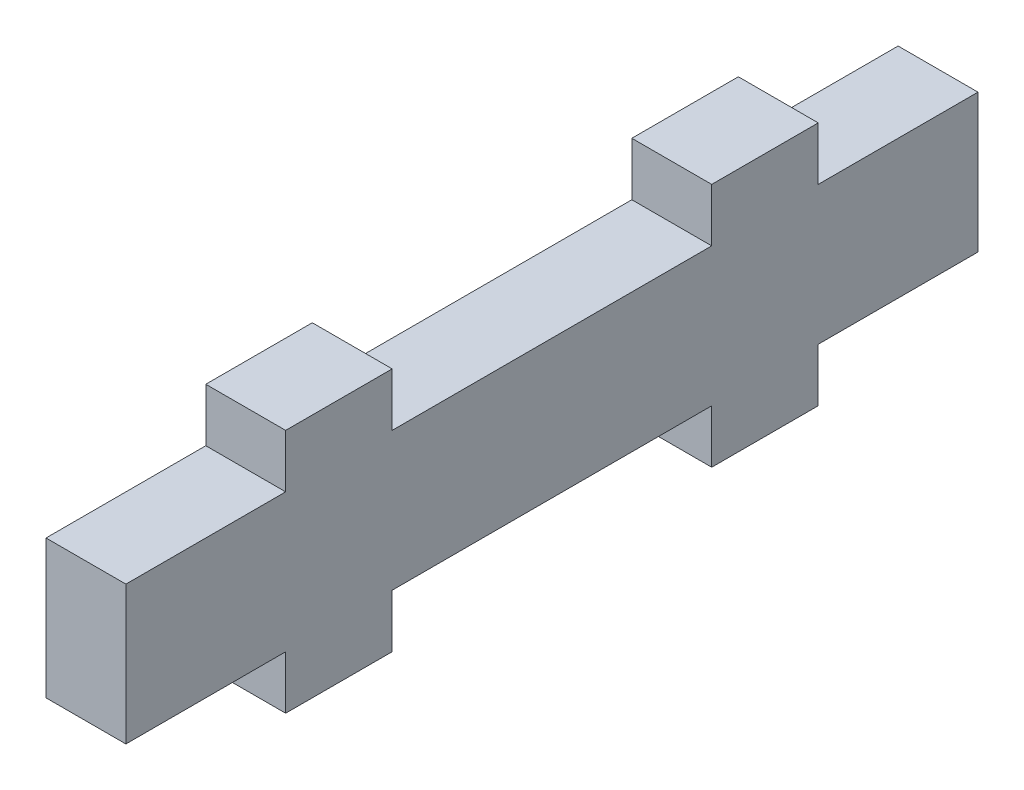
ISO-10303-21;
HEADER;
FILE_DESCRIPTION(('STEP AP214'),'2;1');
FILE_NAME('part.step','',(''),(''),'','','');
FILE_SCHEMA(('AUTOMOTIVE_DESIGN { 1 0 10303 214 1 1 1 1 }'));
ENDSEC;
DATA;
#1=APPLICATION_CONTEXT('core data for automotive mechanical design processes');
#2=APPLICATION_PROTOCOL_DEFINITION('international standard','automotive_design',2000,#1);
#3=PRODUCT_CONTEXT('',#1,'mechanical');
#4=PRODUCT('Part','Part','',(#3));
#5=PRODUCT_RELATED_PRODUCT_CATEGORY('part','',(#4));
#6=PRODUCT_DEFINITION_FORMATION('','',#4);
#7=PRODUCT_DEFINITION_CONTEXT('part definition',#1,'design');
#8=PRODUCT_DEFINITION('design','',#6,#7);
#9=PRODUCT_DEFINITION_SHAPE('','',#8);
#10=(LENGTH_UNIT() NAMED_UNIT(*) SI_UNIT(.MILLI.,.METRE.));
#11=(NAMED_UNIT(*) PLANE_ANGLE_UNIT() SI_UNIT($,.RADIAN.));
#12=(NAMED_UNIT(*) SI_UNIT($,.STERADIAN.) SOLID_ANGLE_UNIT());
#13=UNCERTAINTY_MEASURE_WITH_UNIT(LENGTH_MEASURE(1.E-05),#10,'distance_accuracy_value','');
#14=(GEOMETRIC_REPRESENTATION_CONTEXT(3) GLOBAL_UNCERTAINTY_ASSIGNED_CONTEXT((#13)) GLOBAL_UNIT_ASSIGNED_CONTEXT((#10,
#11,#12)) REPRESENTATION_CONTEXT('',''));
#15=CARTESIAN_POINT('',(0.,0.,0.));
#16=DIRECTION('',(0.,0.,1.));
#17=DIRECTION('',(1.,0.,0.));
#18=AXIS2_PLACEMENT_3D('',#15,#16,#17);
#19=CARTESIAN_POINT('',(45.,-12.9999999999998,0.));
#20=DIRECTION('',(0.,-1.,0.));
#21=DIRECTION('',(0.,0.,-1.));
#22=AXIS2_PLACEMENT_3D('',#19,#20,#21);
#23=PLANE('',#22);
#24=DIRECTION('',(0.,0.,-1.));
#25=VECTOR('',#24,1.);
#26=CARTESIAN_POINT('',(60.,-12.9999999999998,0.));
#27=LINE('',#26,#25);
#28=CARTESIAN_POINT('',(60.,-12.9999999999998,80.0000000000001));
#29=VERTEX_POINT('',#28);
#30=CARTESIAN_POINT('',(60.,-12.9999999999998,50.));
#31=VERTEX_POINT('',#30);
#32=EDGE_CURVE('E208',#29,#31,#27,.T.);
#33=ORIENTED_EDGE('',*,*,#32,.F.);
#34=DIRECTION('',(1.,0.,0.));
#35=VECTOR('',#34,1.);
#36=CARTESIAN_POINT('',(45.,-12.9999999999998,80.0000000000001));
#37=LINE('',#36,#35);
#38=CARTESIAN_POINT('',(45.,-12.9999999999998,80.0000000000001));
#39=VERTEX_POINT('',#38);
#40=EDGE_CURVE('E11',#39,#29,#37,.T.);
#41=ORIENTED_EDGE('',*,*,#40,.F.);
#42=DIRECTION('',(0.,0.,-1.));
#43=VECTOR('',#42,1.);
#44=CARTESIAN_POINT('',(45.,-12.9999999999998,0.));
#45=LINE('',#44,#43);
#46=CARTESIAN_POINT('',(45.,-12.9999999999998,50.));
#47=VERTEX_POINT('',#46);
#48=EDGE_CURVE('E254',#39,#47,#45,.T.);
#49=ORIENTED_EDGE('',*,*,#48,.T.);
#50=DIRECTION('',(1.,0.,0.));
#51=VECTOR('',#50,1.);
#52=CARTESIAN_POINT('',(45.,-12.9999999999998,50.));
#53=LINE('',#52,#51);
#54=EDGE_CURVE('E39',#47,#31,#53,.T.);
#55=ORIENTED_EDGE('',*,*,#54,.T.);
#56=EDGE_LOOP('',(#33,#41,#49,#55));
#57=FACE_BOUND('',#56,.T.);
#58=ADVANCED_FACE('F35',(#57),#23,.T.);
#59=CARTESIAN_POINT('',(45.,0.,80.0000000000001));
#60=DIRECTION('',(0.,0.,-1.));
#61=DIRECTION('',(-1.,0.,0.));
#62=AXIS2_PLACEMENT_3D('',#59,#60,#61);
#63=PLANE('',#62);
#64=DIRECTION('',(0.,1.,0.));
#65=VECTOR('',#64,1.);
#66=CARTESIAN_POINT('',(60.,0.,80.0000000000001));
#67=LINE('',#66,#65);
#68=CARTESIAN_POINT('',(60.,12.9999999999998,80.0000000000001));
#69=VERTEX_POINT('',#68);
#70=EDGE_CURVE('E117',#29,#69,#67,.T.);
#71=ORIENTED_EDGE('',*,*,#70,.T.);
#72=DIRECTION('',(1.,0.,0.));
#73=VECTOR('',#72,1.);
#74=CARTESIAN_POINT('',(45.,12.9999999999998,80.0000000000001));
#75=LINE('',#74,#73);
#76=CARTESIAN_POINT('',(45.,12.9999999999998,80.0000000000001));
#77=VERTEX_POINT('',#76);
#78=EDGE_CURVE('E45',#77,#69,#75,.T.);
#79=ORIENTED_EDGE('',*,*,#78,.F.);
#80=DIRECTION('',(0.,1.,0.));
#81=VECTOR('',#80,1.);
#82=CARTESIAN_POINT('',(45.,0.,80.0000000000001));
#83=LINE('',#82,#81);
#84=EDGE_CURVE('E184',#39,#77,#83,.T.);
#85=ORIENTED_EDGE('',*,*,#84,.F.);
#86=ORIENTED_EDGE('',*,*,#40,.T.);
#87=EDGE_LOOP('',(#71,#79,#85,#86));
#88=FACE_BOUND('',#87,.T.);
#89=ADVANCED_FACE('F386',(#88),#63,.F.);
#90=CARTESIAN_POINT('',(45.,12.9999999999998,0.));
#91=DIRECTION('',(0.,-1.,0.));
#92=DIRECTION('',(0.,0.,-1.));
#93=AXIS2_PLACEMENT_3D('',#90,#91,#92);
#94=PLANE('',#93);
#95=DIRECTION('',(0.,0.,-1.));
#96=VECTOR('',#95,1.);
#97=CARTESIAN_POINT('',(60.,12.9999999999998,0.));
#98=LINE('',#97,#96);
#99=CARTESIAN_POINT('',(60.,12.9999999999998,50.));
#100=VERTEX_POINT('',#99);
#101=EDGE_CURVE('E193',#69,#100,#98,.T.);
#102=ORIENTED_EDGE('',*,*,#101,.T.);
#103=DIRECTION('',(1.,0.,0.));
#104=VECTOR('',#103,1.);
#105=CARTESIAN_POINT('',(45.,12.9999999999998,50.));
#106=LINE('',#105,#104);
#107=CARTESIAN_POINT('',(45.,12.9999999999998,50.));
#108=VERTEX_POINT('',#107);
#109=EDGE_CURVE('E190',#108,#100,#106,.T.);
#110=ORIENTED_EDGE('',*,*,#109,.F.);
#111=DIRECTION('',(0.,0.,-1.));
#112=VECTOR('',#111,1.);
#113=CARTESIAN_POINT('',(45.,12.9999999999998,0.));
#114=LINE('',#113,#112);
#115=EDGE_CURVE('E177',#77,#108,#114,.T.);
#116=ORIENTED_EDGE('',*,*,#115,.F.);
#117=ORIENTED_EDGE('',*,*,#78,.T.);
#118=EDGE_LOOP('',(#102,#110,#116,#117));
#119=FACE_BOUND('',#118,.T.);
#120=ADVANCED_FACE('F191',(#119),#94,.F.);
#121=CARTESIAN_POINT('',(45.,0.,50.));
#122=DIRECTION('',(0.,0.,-1.));
#123=DIRECTION('',(0.,1.,0.));
#124=AXIS2_PLACEMENT_3D('',#121,#122,#123);
#125=PLANE('',#124);
#126=DIRECTION('',(0.,1.,0.));
#127=VECTOR('',#126,1.);
#128=CARTESIAN_POINT('',(60.,0.,50.));
#129=LINE('',#128,#127);
#130=CARTESIAN_POINT('',(60.,23.0000000000003,50.));
#131=VERTEX_POINT('',#130);
#132=EDGE_CURVE('E252',#100,#131,#129,.T.);
#133=ORIENTED_EDGE('',*,*,#132,.T.);
#134=DIRECTION('',(1.,0.,0.));
#135=VECTOR('',#134,1.);
#136=CARTESIAN_POINT('',(45.,23.0000000000003,50.));
#137=LINE('',#136,#135);
#138=CARTESIAN_POINT('',(45.,23.0000000000003,50.));
#139=VERTEX_POINT('',#138);
#140=EDGE_CURVE('E196',#139,#131,#137,.T.);
#141=ORIENTED_EDGE('',*,*,#140,.F.);
#142=DIRECTION('',(0.,1.,0.));
#143=VECTOR('',#142,1.);
#144=CARTESIAN_POINT('',(45.,0.,50.));
#145=LINE('',#144,#143);
#146=EDGE_CURVE('E182',#108,#139,#145,.T.);
#147=ORIENTED_EDGE('',*,*,#146,.F.);
#148=ORIENTED_EDGE('',*,*,#109,.T.);
#149=EDGE_LOOP('',(#133,#141,#147,#148));
#150=FACE_BOUND('',#149,.T.);
#151=ADVANCED_FACE('F198',(#150),#125,.F.);
#152=CARTESIAN_POINT('',(45.,23.0000000000003,0.));
#153=DIRECTION('',(0.,-1.,0.));
#154=DIRECTION('',(0.,0.,-1.));
#155=AXIS2_PLACEMENT_3D('',#152,#153,#154);
#156=PLANE('',#155);
#157=DIRECTION('',(0.,0.,-1.));
#158=VECTOR('',#157,1.);
#159=CARTESIAN_POINT('',(60.,23.0000000000003,0.));
#160=LINE('',#159,#158);
#161=CARTESIAN_POINT('',(60.,23.0000000000003,30.));
#162=VERTEX_POINT('',#161);
#163=EDGE_CURVE('E249',#131,#162,#160,.T.);
#164=ORIENTED_EDGE('',*,*,#163,.T.);
#165=DIRECTION('',(1.,0.,0.));
#166=VECTOR('',#165,1.);
#167=CARTESIAN_POINT('',(45.,23.0000000000003,30.));
#168=LINE('',#167,#166);
#169=CARTESIAN_POINT('',(45.,23.0000000000003,30.));
#170=VERTEX_POINT('',#169);
#171=EDGE_CURVE('E258',#170,#162,#168,.T.);
#172=ORIENTED_EDGE('',*,*,#171,.F.);
#173=DIRECTION('',(0.,0.,-1.));
#174=VECTOR('',#173,1.);
#175=CARTESIAN_POINT('',(45.,23.0000000000003,0.));
#176=LINE('',#175,#174);
#177=EDGE_CURVE('E201',#139,#170,#176,.T.);
#178=ORIENTED_EDGE('',*,*,#177,.F.);
#179=ORIENTED_EDGE('',*,*,#140,.T.);
#180=EDGE_LOOP('',(#164,#172,#178,#179));
#181=FACE_BOUND('',#180,.T.);
#182=ADVANCED_FACE('F450',(#181),#156,.F.);
#183=CARTESIAN_POINT('',(45.,0.,30.));
#184=DIRECTION('',(0.,0.,-1.));
#185=DIRECTION('',(0.,1.,0.));
#186=AXIS2_PLACEMENT_3D('',#183,#184,#185);
#187=PLANE('',#186);
#188=DIRECTION('',(0.,1.,0.));
#189=VECTOR('',#188,1.);
#190=CARTESIAN_POINT('',(60.,0.,30.));
#191=LINE('',#190,#189);
#192=CARTESIAN_POINT('',(60.,12.9999999999998,30.));
#193=VERTEX_POINT('',#192);
#194=EDGE_CURVE('E246',#193,#162,#191,.T.);
#195=ORIENTED_EDGE('',*,*,#194,.F.);
#196=DIRECTION('',(1.,0.,0.));
#197=VECTOR('',#196,1.);
#198=CARTESIAN_POINT('',(45.,12.9999999999998,30.));
#199=LINE('',#198,#197);
#200=CARTESIAN_POINT('',(45.,12.9999999999998,30.));
#201=VERTEX_POINT('',#200);
#202=EDGE_CURVE('E260',#201,#193,#199,.T.);
#203=ORIENTED_EDGE('',*,*,#202,.F.);
#204=DIRECTION('',(0.,1.,0.));
#205=VECTOR('',#204,1.);
#206=CARTESIAN_POINT('',(45.,0.,30.));
#207=LINE('',#206,#205);
#208=EDGE_CURVE('E203',#201,#170,#207,.T.);
#209=ORIENTED_EDGE('',*,*,#208,.T.);
#210=ORIENTED_EDGE('',*,*,#171,.T.);
#211=EDGE_LOOP('',(#195,#203,#209,#210));
#212=FACE_BOUND('',#211,.T.);
#213=ADVANCED_FACE('F442',(#212),#187,.T.);
#214=CARTESIAN_POINT('',(60.,12.9999999999997,-30.));
#215=VERTEX_POINT('',#214);
#216=EDGE_CURVE('E237',#193,#215,#98,.T.);
#217=ORIENTED_EDGE('',*,*,#216,.T.);
#218=DIRECTION('',(1.,0.,0.));
#219=VECTOR('',#218,1.);
#220=CARTESIAN_POINT('',(45.,12.9999999999997,-30.));
#221=LINE('',#220,#219);
#222=CARTESIAN_POINT('',(45.,12.9999999999997,-30.));
#223=VERTEX_POINT('',#222);
#224=EDGE_CURVE('E262',#223,#215,#221,.T.);
#225=ORIENTED_EDGE('',*,*,#224,.F.);
#226=EDGE_CURVE('E187',#201,#223,#114,.T.);
#227=ORIENTED_EDGE('',*,*,#226,.F.);
#228=ORIENTED_EDGE('',*,*,#202,.T.);
#229=EDGE_LOOP('',(#217,#225,#227,#228));
#230=FACE_BOUND('',#229,.T.);
#231=ADVANCED_FACE('F295',(#230),#94,.F.);
#232=CARTESIAN_POINT('',(45.,0.,-30.));
#233=DIRECTION('',(0.,0.,-1.));
#234=DIRECTION('',(0.,1.,0.));
#235=AXIS2_PLACEMENT_3D('',#232,#233,#234);
#236=PLANE('',#235);
#237=DIRECTION('',(0.,1.,0.));
#238=VECTOR('',#237,1.);
#239=CARTESIAN_POINT('',(60.,0.,-30.));
#240=LINE('',#239,#238);
#241=CARTESIAN_POINT('',(60.,23.0000000000003,-30.));
#242=VERTEX_POINT('',#241);
#243=EDGE_CURVE('E243',#215,#242,#240,.T.);
#244=ORIENTED_EDGE('',*,*,#243,.T.);
#245=DIRECTION('',(1.,0.,0.));
#246=VECTOR('',#245,1.);
#247=CARTESIAN_POINT('',(45.,23.0000000000003,-30.));
#248=LINE('',#247,#246);
#249=CARTESIAN_POINT('',(45.,23.0000000000003,-30.));
#250=VERTEX_POINT('',#249);
#251=EDGE_CURVE('E265',#250,#242,#248,.T.);
#252=ORIENTED_EDGE('',*,*,#251,.F.);
#253=DIRECTION('',(0.,1.,0.));
#254=VECTOR('',#253,1.);
#255=CARTESIAN_POINT('',(45.,0.,-30.));
#256=LINE('',#255,#254);
#257=EDGE_CURVE('E303',#223,#250,#256,.T.);
#258=ORIENTED_EDGE('',*,*,#257,.F.);
#259=ORIENTED_EDGE('',*,*,#224,.T.);
#260=EDGE_LOOP('',(#244,#252,#258,#259));
#261=FACE_BOUND('',#260,.T.);
#262=ADVANCED_FACE('F301',(#261),#236,.F.);
#263=CARTESIAN_POINT('',(45.,23.0000000000003,0.));
#264=DIRECTION('',(0.,1.,0.));
#265=DIRECTION('',(0.,0.,1.));
#266=AXIS2_PLACEMENT_3D('',#263,#264,#265);
#267=PLANE('',#266);
#268=DIRECTION('',(0.,0.,1.));
#269=VECTOR('',#268,1.);
#270=CARTESIAN_POINT('',(60.,23.0000000000003,0.));
#271=LINE('',#270,#269);
#272=CARTESIAN_POINT('',(60.,23.0000000000003,-50.));
#273=VERTEX_POINT('',#272);
#274=EDGE_CURVE('E240',#273,#242,#271,.T.);
#275=ORIENTED_EDGE('',*,*,#274,.F.);
#276=DIRECTION('',(1.,0.,0.));
#277=VECTOR('',#276,1.);
#278=CARTESIAN_POINT('',(45.,23.0000000000003,-50.));
#279=LINE('',#278,#277);
#280=CARTESIAN_POINT('',(45.,23.0000000000003,-50.));
#281=VERTEX_POINT('',#280);
#282=EDGE_CURVE('E267',#281,#273,#279,.T.);
#283=ORIENTED_EDGE('',*,*,#282,.F.);
#284=DIRECTION('',(0.,0.,1.));
#285=VECTOR('',#284,1.);
#286=CARTESIAN_POINT('',(45.,23.0000000000003,0.));
#287=LINE('',#286,#285);
#288=EDGE_CURVE('E311',#281,#250,#287,.T.);
#289=ORIENTED_EDGE('',*,*,#288,.T.);
#290=ORIENTED_EDGE('',*,*,#251,.T.);
#291=EDGE_LOOP('',(#275,#283,#289,#290));
#292=FACE_BOUND('',#291,.T.);
#293=ADVANCED_FACE('F308',(#292),#267,.T.);
#294=CARTESIAN_POINT('',(45.,0.,-50.));
#295=DIRECTION('',(0.,0.,-1.));
#296=DIRECTION('',(0.,1.,0.));
#297=AXIS2_PLACEMENT_3D('',#294,#295,#296);
#298=PLANE('',#297);
#299=DIRECTION('',(0.,1.,0.));
#300=VECTOR('',#299,1.);
#301=CARTESIAN_POINT('',(60.,0.,-50.));
#302=LINE('',#301,#300);
#303=CARTESIAN_POINT('',(60.,12.9999999999997,-50.));
#304=VERTEX_POINT('',#303);
#305=EDGE_CURVE('E236',#304,#273,#302,.T.);
#306=ORIENTED_EDGE('',*,*,#305,.F.);
#307=DIRECTION('',(1.,0.,0.));
#308=VECTOR('',#307,1.);
#309=CARTESIAN_POINT('',(45.,12.9999999999997,-50.));
#310=LINE('',#309,#308);
#311=CARTESIAN_POINT('',(45.,12.9999999999997,-50.));
#312=VERTEX_POINT('',#311);
#313=EDGE_CURVE('E269',#312,#304,#310,.T.);
#314=ORIENTED_EDGE('',*,*,#313,.F.);
#315=DIRECTION('',(0.,1.,0.));
#316=VECTOR('',#315,1.);
#317=CARTESIAN_POINT('',(45.,0.,-50.));
#318=LINE('',#317,#316);
#319=EDGE_CURVE('E314',#312,#281,#318,.T.);
#320=ORIENTED_EDGE('',*,*,#319,.T.);
#321=ORIENTED_EDGE('',*,*,#282,.T.);
#322=EDGE_LOOP('',(#306,#314,#320,#321));
#323=FACE_BOUND('',#322,.T.);
#324=ADVANCED_FACE('F375',(#323),#298,.T.);
#325=CARTESIAN_POINT('',(60.,12.9999999999997,-80.));
#326=VERTEX_POINT('',#325);
#327=EDGE_CURVE('E233',#304,#326,#98,.T.);
#328=ORIENTED_EDGE('',*,*,#327,.T.);
#329=DIRECTION('',(1.,0.,0.));
#330=VECTOR('',#329,1.);
#331=CARTESIAN_POINT('',(45.,12.9999999999997,-80.));
#332=LINE('',#331,#330);
#333=CARTESIAN_POINT('',(45.,12.9999999999997,-80.));
#334=VERTEX_POINT('',#333);
#335=EDGE_CURVE('E271',#334,#326,#332,.T.);
#336=ORIENTED_EDGE('',*,*,#335,.F.);
#337=EDGE_CURVE('E188',#312,#334,#114,.T.);
#338=ORIENTED_EDGE('',*,*,#337,.F.);
#339=ORIENTED_EDGE('',*,*,#313,.T.);
#340=EDGE_LOOP('',(#328,#336,#338,#339));
#341=FACE_BOUND('',#340,.T.);
#342=ADVANCED_FACE('F373',(#341),#94,.F.);
#343=CARTESIAN_POINT('',(45.,0.,-80.));
#344=DIRECTION('',(0.,0.,-1.));
#345=DIRECTION('',(-1.,0.,0.));
#346=AXIS2_PLACEMENT_3D('',#343,#344,#345);
#347=PLANE('',#346);
#348=DIRECTION('',(0.,1.,0.));
#349=VECTOR('',#348,1.);
#350=CARTESIAN_POINT('',(60.,0.,-80.));
#351=LINE('',#350,#349);
#352=CARTESIAN_POINT('',(60.,-12.9999999999998,-80.));
#353=VERTEX_POINT('',#352);
#354=EDGE_CURVE('E230',#353,#326,#351,.T.);
#355=ORIENTED_EDGE('',*,*,#354,.F.);
#356=DIRECTION('',(1.,0.,0.));
#357=VECTOR('',#356,1.);
#358=CARTESIAN_POINT('',(45.,-12.9999999999998,-80.));
#359=LINE('',#358,#357);
#360=CARTESIAN_POINT('',(45.,-12.9999999999998,-80.));
#361=VERTEX_POINT('',#360);
#362=EDGE_CURVE('E273',#361,#353,#359,.T.);
#363=ORIENTED_EDGE('',*,*,#362,.F.);
#364=DIRECTION('',(0.,1.,0.));
#365=VECTOR('',#364,1.);
#366=CARTESIAN_POINT('',(45.,0.,-80.));
#367=LINE('',#366,#365);
#368=EDGE_CURVE('E322',#361,#334,#367,.T.);
#369=ORIENTED_EDGE('',*,*,#368,.T.);
#370=ORIENTED_EDGE('',*,*,#335,.T.);
#371=EDGE_LOOP('',(#355,#363,#369,#370));
#372=FACE_BOUND('',#371,.T.);
#373=ADVANCED_FACE('F371',(#372),#347,.T.);
#374=CARTESIAN_POINT('',(60.,-12.9999999999998,-50.));
#375=VERTEX_POINT('',#374);
#376=EDGE_CURVE('E212',#375,#353,#27,.T.);
#377=ORIENTED_EDGE('',*,*,#376,.F.);
#378=DIRECTION('',(1.,0.,0.));
#379=VECTOR('',#378,1.);
#380=CARTESIAN_POINT('',(45.,-12.9999999999998,-50.));
#381=LINE('',#380,#379);
#382=CARTESIAN_POINT('',(45.,-12.9999999999998,-50.));
#383=VERTEX_POINT('',#382);
#384=EDGE_CURVE('E275',#383,#375,#381,.T.);
#385=ORIENTED_EDGE('',*,*,#384,.F.);
#386=EDGE_CURVE('E327',#383,#361,#45,.T.);
#387=ORIENTED_EDGE('',*,*,#386,.T.);
#388=ORIENTED_EDGE('',*,*,#362,.T.);
#389=EDGE_LOOP('',(#377,#385,#387,#388));
#390=FACE_BOUND('',#389,.T.);
#391=ADVANCED_FACE('F368',(#390),#23,.T.);
#392=CARTESIAN_POINT('',(45.,0.,-50.));
#393=DIRECTION('',(0.,0.,1.));
#394=DIRECTION('',(0.,-1.,0.));
#395=AXIS2_PLACEMENT_3D('',#392,#393,#394);
#396=PLANE('',#395);
#397=DIRECTION('',(0.,-1.,0.));
#398=VECTOR('',#397,1.);
#399=CARTESIAN_POINT('',(60.,0.,-50.));
#400=LINE('',#399,#398);
#401=CARTESIAN_POINT('',(60.,-23.0000000000003,-50.));
#402=VERTEX_POINT('',#401);
#403=EDGE_CURVE('E228',#375,#402,#400,.T.);
#404=ORIENTED_EDGE('',*,*,#403,.T.);
#405=DIRECTION('',(1.,0.,0.));
#406=VECTOR('',#405,1.);
#407=CARTESIAN_POINT('',(45.,-23.0000000000003,-50.));
#408=LINE('',#407,#406);
#409=CARTESIAN_POINT('',(45.,-23.0000000000003,-50.));
#410=VERTEX_POINT('',#409);
#411=EDGE_CURVE('E277',#410,#402,#408,.T.);
#412=ORIENTED_EDGE('',*,*,#411,.F.);
#413=DIRECTION('',(0.,-1.,0.));
#414=VECTOR('',#413,1.);
#415=CARTESIAN_POINT('',(45.,0.,-50.));
#416=LINE('',#415,#414);
#417=EDGE_CURVE('E330',#383,#410,#416,.T.);
#418=ORIENTED_EDGE('',*,*,#417,.F.);
#419=ORIENTED_EDGE('',*,*,#384,.T.);
#420=EDGE_LOOP('',(#404,#412,#418,#419));
#421=FACE_BOUND('',#420,.T.);
#422=ADVANCED_FACE('F396',(#421),#396,.F.);
#423=CARTESIAN_POINT('',(45.,-23.0000000000003,0.));
#424=DIRECTION('',(0.,1.,0.));
#425=DIRECTION('',(0.,0.,1.));
#426=AXIS2_PLACEMENT_3D('',#423,#424,#425);
#427=PLANE('',#426);
#428=DIRECTION('',(0.,0.,1.));
#429=VECTOR('',#428,1.);
#430=CARTESIAN_POINT('',(60.,-23.0000000000003,0.));
#431=LINE('',#430,#429);
#432=CARTESIAN_POINT('',(60.,-23.0000000000003,-30.));
#433=VERTEX_POINT('',#432);
#434=EDGE_CURVE('E225',#402,#433,#431,.T.);
#435=ORIENTED_EDGE('',*,*,#434,.T.);
#436=DIRECTION('',(1.,0.,0.));
#437=VECTOR('',#436,1.);
#438=CARTESIAN_POINT('',(45.,-23.0000000000003,-30.));
#439=LINE('',#438,#437);
#440=CARTESIAN_POINT('',(45.,-23.0000000000003,-30.));
#441=VERTEX_POINT('',#440);
#442=EDGE_CURVE('E280',#441,#433,#439,.T.);
#443=ORIENTED_EDGE('',*,*,#442,.F.);
#444=DIRECTION('',(0.,0.,1.));
#445=VECTOR('',#444,1.);
#446=CARTESIAN_POINT('',(45.,-23.0000000000003,0.));
#447=LINE('',#446,#445);
#448=EDGE_CURVE('E335',#410,#441,#447,.T.);
#449=ORIENTED_EDGE('',*,*,#448,.F.);
#450=ORIENTED_EDGE('',*,*,#411,.T.);
#451=EDGE_LOOP('',(#435,#443,#449,#450));
#452=FACE_BOUND('',#451,.T.);
#453=ADVANCED_FACE('F401',(#452),#427,.F.);
#454=CARTESIAN_POINT('',(45.,0.,-30.));
#455=DIRECTION('',(0.,0.,1.));
#456=DIRECTION('',(0.,-1.,0.));
#457=AXIS2_PLACEMENT_3D('',#454,#455,#456);
#458=PLANE('',#457);
#459=DIRECTION('',(0.,-1.,0.));
#460=VECTOR('',#459,1.);
#461=CARTESIAN_POINT('',(60.,0.,-30.));
#462=LINE('',#461,#460);
#463=CARTESIAN_POINT('',(60.,-12.9999999999998,-30.));
#464=VERTEX_POINT('',#463);
#465=EDGE_CURVE('E222',#464,#433,#462,.T.);
#466=ORIENTED_EDGE('',*,*,#465,.F.);
#467=DIRECTION('',(1.,0.,0.));
#468=VECTOR('',#467,1.);
#469=CARTESIAN_POINT('',(45.,-12.9999999999998,-30.));
#470=LINE('',#469,#468);
#471=CARTESIAN_POINT('',(45.,-12.9999999999998,-30.));
#472=VERTEX_POINT('',#471);
#473=EDGE_CURVE('E282',#472,#464,#470,.T.);
#474=ORIENTED_EDGE('',*,*,#473,.F.);
#475=DIRECTION('',(0.,-1.,0.));
#476=VECTOR('',#475,1.);
#477=CARTESIAN_POINT('',(45.,0.,-30.));
#478=LINE('',#477,#476);
#479=EDGE_CURVE('E337',#472,#441,#478,.T.);
#480=ORIENTED_EDGE('',*,*,#479,.T.);
#481=ORIENTED_EDGE('',*,*,#442,.T.);
#482=EDGE_LOOP('',(#466,#474,#480,#481));
#483=FACE_BOUND('',#482,.T.);
#484=ADVANCED_FACE('F359',(#483),#458,.T.);
#485=CARTESIAN_POINT('',(60.,-12.9999999999998,30.));
#486=VERTEX_POINT('',#485);
#487=EDGE_CURVE('E213',#486,#464,#27,.T.);
#488=ORIENTED_EDGE('',*,*,#487,.F.);
#489=DIRECTION('',(1.,0.,0.));
#490=VECTOR('',#489,1.);
#491=CARTESIAN_POINT('',(45.,-12.9999999999998,30.));
#492=LINE('',#491,#490);
#493=CARTESIAN_POINT('',(45.,-12.9999999999998,30.));
#494=VERTEX_POINT('',#493);
#495=EDGE_CURVE('E284',#494,#486,#492,.T.);
#496=ORIENTED_EDGE('',*,*,#495,.F.);
#497=EDGE_CURVE('E332',#494,#472,#45,.T.);
#498=ORIENTED_EDGE('',*,*,#497,.T.);
#499=ORIENTED_EDGE('',*,*,#473,.T.);
#500=EDGE_LOOP('',(#488,#496,#498,#499));
#501=FACE_BOUND('',#500,.T.);
#502=ADVANCED_FACE('F350',(#501),#23,.T.);
#503=CARTESIAN_POINT('',(45.,0.,30.));
#504=DIRECTION('',(0.,0.,1.));
#505=DIRECTION('',(0.,-1.,0.));
#506=AXIS2_PLACEMENT_3D('',#503,#504,#505);
#507=PLANE('',#506);
#508=DIRECTION('',(0.,-1.,0.));
#509=VECTOR('',#508,1.);
#510=CARTESIAN_POINT('',(60.,0.,30.));
#511=LINE('',#510,#509);
#512=CARTESIAN_POINT('',(60.,-23.0000000000003,30.));
#513=VERTEX_POINT('',#512);
#514=EDGE_CURVE('E219',#486,#513,#511,.T.);
#515=ORIENTED_EDGE('',*,*,#514,.T.);
#516=DIRECTION('',(1.,0.,0.));
#517=VECTOR('',#516,1.);
#518=CARTESIAN_POINT('',(45.,-23.0000000000003,30.));
#519=LINE('',#518,#517);
#520=CARTESIAN_POINT('',(45.,-23.0000000000003,30.));
#521=VERTEX_POINT('',#520);
#522=EDGE_CURVE('E286',#521,#513,#519,.T.);
#523=ORIENTED_EDGE('',*,*,#522,.F.);
#524=DIRECTION('',(0.,-1.,0.));
#525=VECTOR('',#524,1.);
#526=CARTESIAN_POINT('',(45.,0.,30.));
#527=LINE('',#526,#525);
#528=EDGE_CURVE('E340',#494,#521,#527,.T.);
#529=ORIENTED_EDGE('',*,*,#528,.F.);
#530=ORIENTED_EDGE('',*,*,#495,.T.);
#531=EDGE_LOOP('',(#515,#523,#529,#530));
#532=FACE_BOUND('',#531,.T.);
#533=ADVANCED_FACE('F394',(#532),#507,.F.);
#534=CARTESIAN_POINT('',(45.,-23.0000000000003,0.));
#535=DIRECTION('',(0.,-1.,0.));
#536=DIRECTION('',(0.,0.,-1.));
#537=AXIS2_PLACEMENT_3D('',#534,#535,#536);
#538=PLANE('',#537);
#539=DIRECTION('',(0.,0.,-1.));
#540=VECTOR('',#539,1.);
#541=CARTESIAN_POINT('',(60.,-23.0000000000003,0.));
#542=LINE('',#541,#540);
#543=CARTESIAN_POINT('',(60.,-23.0000000000003,50.));
#544=VERTEX_POINT('',#543);
#545=EDGE_CURVE('E216',#544,#513,#542,.T.);
#546=ORIENTED_EDGE('',*,*,#545,.F.);
#547=DIRECTION('',(1.,0.,0.));
#548=VECTOR('',#547,1.);
#549=CARTESIAN_POINT('',(45.,-23.0000000000003,50.));
#550=LINE('',#549,#548);
#551=CARTESIAN_POINT('',(45.,-23.0000000000003,50.));
#552=VERTEX_POINT('',#551);
#553=EDGE_CURVE('E287',#552,#544,#550,.T.);
#554=ORIENTED_EDGE('',*,*,#553,.F.);
#555=DIRECTION('',(0.,0.,-1.));
#556=VECTOR('',#555,1.);
#557=CARTESIAN_POINT('',(45.,-23.0000000000003,0.));
#558=LINE('',#557,#556);
#559=EDGE_CURVE('E342',#552,#521,#558,.T.);
#560=ORIENTED_EDGE('',*,*,#559,.T.);
#561=ORIENTED_EDGE('',*,*,#522,.T.);
#562=EDGE_LOOP('',(#546,#554,#560,#561));
#563=FACE_BOUND('',#562,.T.);
#564=ADVANCED_FACE('F511',(#563),#538,.T.);
#565=CARTESIAN_POINT('',(45.,0.,50.));
#566=DIRECTION('',(0.,0.,1.));
#567=DIRECTION('',(1.,0.,0.));
#568=AXIS2_PLACEMENT_3D('',#565,#566,#567);
#569=PLANE('',#568);
#570=DIRECTION('',(0.,-1.,0.));
#571=VECTOR('',#570,1.);
#572=CARTESIAN_POINT('',(60.,0.,50.));
#573=LINE('',#572,#571);
#574=EDGE_CURVE('E211',#31,#544,#573,.T.);
#575=ORIENTED_EDGE('',*,*,#574,.F.);
#576=ORIENTED_EDGE('',*,*,#54,.F.);
#577=DIRECTION('',(0.,-1.,0.));
#578=VECTOR('',#577,1.);
#579=CARTESIAN_POINT('',(45.,0.,50.));
#580=LINE('',#579,#578);
#581=EDGE_CURVE('E345',#47,#552,#580,.T.);
#582=ORIENTED_EDGE('',*,*,#581,.T.);
#583=ORIENTED_EDGE('',*,*,#553,.T.);
#584=EDGE_LOOP('',(#575,#576,#582,#583));
#585=FACE_BOUND('',#584,.T.);
#586=ADVANCED_FACE('F37',(#585),#569,.T.);
#587=CARTESIAN_POINT('',(45.,0.,0.));
#588=DIRECTION('',(1.,0.,0.));
#589=DIRECTION('',(0.,0.,-1.));
#590=AXIS2_PLACEMENT_3D('',#587,#588,#589);
#591=PLANE('',#590);
#592=ORIENTED_EDGE('',*,*,#48,.F.);
#593=ORIENTED_EDGE('',*,*,#84,.T.);
#594=ORIENTED_EDGE('',*,*,#115,.T.);
#595=ORIENTED_EDGE('',*,*,#146,.T.);
#596=ORIENTED_EDGE('',*,*,#177,.T.);
#597=ORIENTED_EDGE('',*,*,#208,.F.);
#598=ORIENTED_EDGE('',*,*,#226,.T.);
#599=ORIENTED_EDGE('',*,*,#257,.T.);
#600=ORIENTED_EDGE('',*,*,#288,.F.);
#601=ORIENTED_EDGE('',*,*,#319,.F.);
#602=ORIENTED_EDGE('',*,*,#337,.T.);
#603=ORIENTED_EDGE('',*,*,#368,.F.);
#604=ORIENTED_EDGE('',*,*,#386,.F.);
#605=ORIENTED_EDGE('',*,*,#417,.T.);
#606=ORIENTED_EDGE('',*,*,#448,.T.);
#607=ORIENTED_EDGE('',*,*,#479,.F.);
#608=ORIENTED_EDGE('',*,*,#497,.F.);
#609=ORIENTED_EDGE('',*,*,#528,.T.);
#610=ORIENTED_EDGE('',*,*,#559,.F.);
#611=ORIENTED_EDGE('',*,*,#581,.F.);
#612=EDGE_LOOP('',(#592,#593,#594,#595,#596,#597,#598,#599,#600,#601,#602,#603,#604,#605,#606,
#607,#608,#609,#610,#611));
#613=FACE_BOUND('',#612,.T.);
#614=ADVANCED_FACE('F180',(#613),#591,.F.);
#615=CARTESIAN_POINT('',(60.,0.,0.));
#616=DIRECTION('',(1.,0.,0.));
#617=DIRECTION('',(0.,0.,-1.));
#618=AXIS2_PLACEMENT_3D('',#615,#616,#617);
#619=PLANE('',#618);
#620=ORIENTED_EDGE('',*,*,#32,.T.);
#621=ORIENTED_EDGE('',*,*,#574,.T.);
#622=ORIENTED_EDGE('',*,*,#545,.T.);
#623=ORIENTED_EDGE('',*,*,#514,.F.);
#624=ORIENTED_EDGE('',*,*,#487,.T.);
#625=ORIENTED_EDGE('',*,*,#465,.T.);
#626=ORIENTED_EDGE('',*,*,#434,.F.);
#627=ORIENTED_EDGE('',*,*,#403,.F.);
#628=ORIENTED_EDGE('',*,*,#376,.T.);
#629=ORIENTED_EDGE('',*,*,#354,.T.);
#630=ORIENTED_EDGE('',*,*,#327,.F.);
#631=ORIENTED_EDGE('',*,*,#305,.T.);
#632=ORIENTED_EDGE('',*,*,#274,.T.);
#633=ORIENTED_EDGE('',*,*,#243,.F.);
#634=ORIENTED_EDGE('',*,*,#216,.F.);
#635=ORIENTED_EDGE('',*,*,#194,.T.);
#636=ORIENTED_EDGE('',*,*,#163,.F.);
#637=ORIENTED_EDGE('',*,*,#132,.F.);
#638=ORIENTED_EDGE('',*,*,#101,.F.);
#639=ORIENTED_EDGE('',*,*,#70,.F.);
#640=EDGE_LOOP('',(#620,#621,#622,#623,#624,#625,#626,#627,#628,#629,#630,#631,#632,#633,#634,
#635,#636,#637,#638,#639));
#641=FACE_BOUND('',#640,.T.);
#642=ADVANCED_FACE('F290',(#641),#619,.T.);
#643=CLOSED_SHELL('',(#58,#89,#120,#151,#182,#213,#231,#262,#293,#324,#342,#373,#391,#422,#453,
#484,#502,#533,#564,#586,#614,#642));
#644=MANIFOLD_SOLID_BREP('B2',#643);
#645=ADVANCED_BREP_SHAPE_REPRESENTATION('',(#18,#644),#14);
#646=SHAPE_DEFINITION_REPRESENTATION(#9,#645);
ENDSEC;
END-ISO-10303-21;
